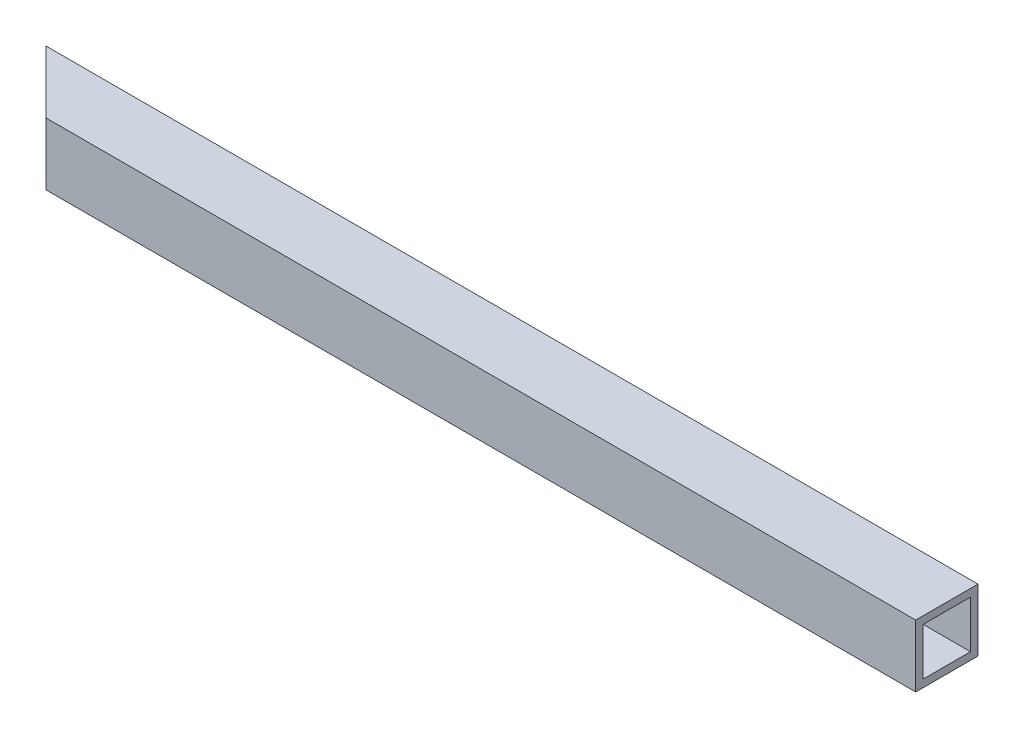
ISO-10303-21;
HEADER;
FILE_DESCRIPTION(('STEP AP214'),'2;1');
FILE_NAME('part.step','',(''),(''),'','','');
FILE_SCHEMA(('AUTOMOTIVE_DESIGN { 1 0 10303 214 1 1 1 1 }'));
ENDSEC;
DATA;
#1=APPLICATION_CONTEXT('core data for automotive mechanical design processes');
#2=APPLICATION_PROTOCOL_DEFINITION('international standard','automotive_design',2000,#1);
#3=PRODUCT_CONTEXT('',#1,'mechanical');
#4=PRODUCT('Part','Part','',(#3));
#5=PRODUCT_RELATED_PRODUCT_CATEGORY('part','',(#4));
#6=PRODUCT_DEFINITION_FORMATION('','',#4);
#7=PRODUCT_DEFINITION_CONTEXT('part definition',#1,'design');
#8=PRODUCT_DEFINITION('design','',#6,#7);
#9=PRODUCT_DEFINITION_SHAPE('','',#8);
#10=(LENGTH_UNIT() NAMED_UNIT(*) SI_UNIT(.MILLI.,.METRE.));
#11=(NAMED_UNIT(*) PLANE_ANGLE_UNIT() SI_UNIT($,.RADIAN.));
#12=(NAMED_UNIT(*) SI_UNIT($,.STERADIAN.) SOLID_ANGLE_UNIT());
#13=UNCERTAINTY_MEASURE_WITH_UNIT(LENGTH_MEASURE(1.E-05),#10,'distance_accuracy_value','');
#14=(GEOMETRIC_REPRESENTATION_CONTEXT(3) GLOBAL_UNCERTAINTY_ASSIGNED_CONTEXT((#13)) GLOBAL_UNIT_ASSIGNED_CONTEXT((#10,
#11,#12)) REPRESENTATION_CONTEXT('',''));
#15=CARTESIAN_POINT('',(0.,0.,0.));
#16=DIRECTION('',(0.,0.,1.));
#17=DIRECTION('',(1.,0.,0.));
#18=AXIS2_PLACEMENT_3D('',#15,#16,#17);
#19=CARTESIAN_POINT('',(-174.5,25.,-170.560948081264));
#20=DIRECTION('',(0.707106781186547,0.,-0.707106781186547));
#21=DIRECTION('',(-0.707106781186548,0.,-0.707106781186548));
#22=AXIS2_PLACEMENT_3D('',#19,#20,#21);
#23=PLANE('',#22);
#24=DIRECTION('',(0.707106781186547,0.,0.707106781186547));
#25=VECTOR('',#24,1.);
#26=CARTESIAN_POINT('',(-174.5,0.,-170.560948081264));
#27=LINE('',#26,#25);
#28=CARTESIAN_POINT('',(-199.5,0.,-195.560948081264));
#29=VERTEX_POINT('',#28);
#30=CARTESIAN_POINT('',(-174.5,0.,-170.560948081264));
#31=VERTEX_POINT('',#30);
#32=EDGE_CURVE('E129',#29,#31,#27,.T.);
#33=ORIENTED_EDGE('',*,*,#32,.T.);
#34=DIRECTION('',(0.,-1.,0.));
#35=VECTOR('',#34,1.);
#36=CARTESIAN_POINT('',(-174.5,25.,-170.560948081264));
#37=LINE('',#36,#35);
#38=CARTESIAN_POINT('',(-174.5,25.,-170.560948081264));
#39=VERTEX_POINT('',#38);
#40=EDGE_CURVE('E11',#39,#31,#37,.T.);
#41=ORIENTED_EDGE('',*,*,#40,.F.);
#42=DIRECTION('',(0.707106781186547,0.,0.707106781186547));
#43=VECTOR('',#42,1.);
#44=CARTESIAN_POINT('',(-174.5,25.,-170.560948081264));
#45=LINE('',#44,#43);
#46=CARTESIAN_POINT('',(-199.5,25.,-195.560948081264));
#47=VERTEX_POINT('',#46);
#48=EDGE_CURVE('E134',#47,#39,#45,.T.);
#49=ORIENTED_EDGE('',*,*,#48,.F.);
#50=DIRECTION('',(0.,-1.,0.));
#51=VECTOR('',#50,1.);
#52=CARTESIAN_POINT('',(-199.5,25.,-195.560948081264));
#53=LINE('',#52,#51);
#54=EDGE_CURVE('E144',#47,#29,#53,.T.);
#55=ORIENTED_EDGE('',*,*,#54,.T.);
#56=EDGE_LOOP('',(#33,#41,#49,#55));
#57=FACE_BOUND('',#56,.T.);
#58=DIRECTION('',(0.707106781186548,0.,0.707106781186548));
#59=VECTOR('',#58,1.);
#60=CARTESIAN_POINT('',(-1.96952595936798,3.,1.96952595936798));
#61=LINE('',#60,#59);
#62=CARTESIAN_POINT('',(-196.5,3.,-192.560948081264));
#63=VERTEX_POINT('',#62);
#64=CARTESIAN_POINT('',(-177.5,3.,-173.560948081264));
#65=VERTEX_POINT('',#64);
#66=EDGE_CURVE('E105',#63,#65,#61,.T.);
#67=ORIENTED_EDGE('',*,*,#66,.F.);
#68=DIRECTION('',(0.,-1.,0.));
#69=VECTOR('',#68,1.);
#70=CARTESIAN_POINT('',(-196.5,25.,-192.560948081264));
#71=LINE('',#70,#69);
#72=CARTESIAN_POINT('',(-196.5,22.,-192.560948081264));
#73=VERTEX_POINT('',#72);
#74=EDGE_CURVE('E125',#73,#63,#71,.T.);
#75=ORIENTED_EDGE('',*,*,#74,.F.);
#76=DIRECTION('',(0.707106781186548,0.,0.707106781186548));
#77=VECTOR('',#76,1.);
#78=CARTESIAN_POINT('',(-1.96952595936798,22.,1.96952595936798));
#79=LINE('',#78,#77);
#80=CARTESIAN_POINT('',(-177.5,22.,-173.560948081264));
#81=VERTEX_POINT('',#80);
#82=EDGE_CURVE('E49',#73,#81,#79,.T.);
#83=ORIENTED_EDGE('',*,*,#82,.T.);
#84=DIRECTION('',(0.,-1.,0.));
#85=VECTOR('',#84,1.);
#86=CARTESIAN_POINT('',(-177.5,25.,-173.560948081264));
#87=LINE('',#86,#85);
#88=EDGE_CURVE('E115',#81,#65,#87,.T.);
#89=ORIENTED_EDGE('',*,*,#88,.T.);
#90=EDGE_LOOP('',(#67,#75,#83,#89));
#91=FACE_BOUND('',#90,.T.);
#92=ADVANCED_FACE('F35',(#57,#91),#23,.F.);
#93=CARTESIAN_POINT('',(174.5,25.,-170.560948081264));
#94=DIRECTION('',(-1.,0.,0.));
#95=DIRECTION('',(0.,0.,1.));
#96=AXIS2_PLACEMENT_3D('',#93,#94,#95);
#97=PLANE('',#96);
#98=DIRECTION('',(0.,0.,-1.));
#99=VECTOR('',#98,1.);
#100=CARTESIAN_POINT('',(174.5,0.,-170.560948081264));
#101=LINE('',#100,#99);
#102=CARTESIAN_POINT('',(174.5,0.,-170.560948081264));
#103=VERTEX_POINT('',#102);
#104=CARTESIAN_POINT('',(174.5,0.,-195.560948081264));
#105=VERTEX_POINT('',#104);
#106=EDGE_CURVE('E149',#103,#105,#101,.T.);
#107=ORIENTED_EDGE('',*,*,#106,.T.);
#108=DIRECTION('',(0.,-1.,0.));
#109=VECTOR('',#108,1.);
#110=CARTESIAN_POINT('',(174.5,25.,-195.560948081264));
#111=LINE('',#110,#109);
#112=CARTESIAN_POINT('',(174.5,25.,-195.560948081264));
#113=VERTEX_POINT('',#112);
#114=EDGE_CURVE('E154',#113,#105,#111,.T.);
#115=ORIENTED_EDGE('',*,*,#114,.F.);
#116=DIRECTION('',(0.,0.,-1.));
#117=VECTOR('',#116,1.);
#118=CARTESIAN_POINT('',(174.5,25.,-170.560948081264));
#119=LINE('',#118,#117);
#120=CARTESIAN_POINT('',(174.5,25.,-170.560948081264));
#121=VERTEX_POINT('',#120);
#122=EDGE_CURVE('E140',#121,#113,#119,.T.);
#123=ORIENTED_EDGE('',*,*,#122,.F.);
#124=DIRECTION('',(0.,-1.,0.));
#125=VECTOR('',#124,1.);
#126=CARTESIAN_POINT('',(174.5,25.,-170.560948081264));
#127=LINE('',#126,#125);
#128=EDGE_CURVE('E42',#121,#103,#127,.T.);
#129=ORIENTED_EDGE('',*,*,#128,.T.);
#130=EDGE_LOOP('',(#107,#115,#123,#129));
#131=FACE_BOUND('',#130,.T.);
#132=DIRECTION('',(0.,0.,-1.));
#133=VECTOR('',#132,1.);
#134=CARTESIAN_POINT('',(174.5,3.,0.));
#135=LINE('',#134,#133);
#136=CARTESIAN_POINT('',(174.5,3.,-173.560948081264));
#137=VERTEX_POINT('',#136);
#138=CARTESIAN_POINT('',(174.5,3.,-192.560948081264));
#139=VERTEX_POINT('',#138);
#140=EDGE_CURVE('E102',#137,#139,#135,.T.);
#141=ORIENTED_EDGE('',*,*,#140,.F.);
#142=DIRECTION('',(0.,-1.,0.));
#143=VECTOR('',#142,1.);
#144=CARTESIAN_POINT('',(174.5,25.,-173.560948081264));
#145=LINE('',#144,#143);
#146=CARTESIAN_POINT('',(174.5,22.,-173.560948081264));
#147=VERTEX_POINT('',#146);
#148=EDGE_CURVE('E111',#147,#137,#145,.T.);
#149=ORIENTED_EDGE('',*,*,#148,.F.);
#150=DIRECTION('',(0.,0.,-1.));
#151=VECTOR('',#150,1.);
#152=CARTESIAN_POINT('',(174.5,22.,0.));
#153=LINE('',#152,#151);
#154=CARTESIAN_POINT('',(174.5,22.,-192.560948081264));
#155=VERTEX_POINT('',#154);
#156=EDGE_CURVE('E54',#147,#155,#153,.T.);
#157=ORIENTED_EDGE('',*,*,#156,.T.);
#158=DIRECTION('',(0.,-1.,0.));
#159=VECTOR('',#158,1.);
#160=CARTESIAN_POINT('',(174.5,25.,-192.560948081264));
#161=LINE('',#160,#159);
#162=EDGE_CURVE('E116',#155,#139,#161,.T.);
#163=ORIENTED_EDGE('',*,*,#162,.T.);
#164=EDGE_LOOP('',(#141,#149,#157,#163));
#165=FACE_BOUND('',#164,.T.);
#166=ADVANCED_FACE('F119',(#131,#165),#97,.F.);
#167=CARTESIAN_POINT('',(-174.5,25.,-170.560948081264));
#168=DIRECTION('',(0.,0.,-1.));
#169=DIRECTION('',(-1.,0.,0.));
#170=AXIS2_PLACEMENT_3D('',#167,#168,#169);
#171=PLANE('',#170);
#172=DIRECTION('',(1.,0.,0.));
#173=VECTOR('',#172,1.);
#174=CARTESIAN_POINT('',(-174.5,0.,-170.560948081264));
#175=LINE('',#174,#173);
#176=EDGE_CURVE('E147',#31,#103,#175,.T.);
#177=ORIENTED_EDGE('',*,*,#176,.T.);
#178=ORIENTED_EDGE('',*,*,#128,.F.);
#179=DIRECTION('',(1.,0.,0.));
#180=VECTOR('',#179,1.);
#181=CARTESIAN_POINT('',(-174.5,25.,-170.560948081264));
#182=LINE('',#181,#180);
#183=EDGE_CURVE('E137',#39,#121,#182,.T.);
#184=ORIENTED_EDGE('',*,*,#183,.F.);
#185=ORIENTED_EDGE('',*,*,#40,.T.);
#186=EDGE_LOOP('',(#177,#178,#184,#185));
#187=FACE_BOUND('',#186,.T.);
#188=ADVANCED_FACE('F177',(#187),#171,.F.);
#189=CARTESIAN_POINT('',(-199.5,25.,-195.560948081264));
#190=DIRECTION('',(0.,0.,1.));
#191=DIRECTION('',(1.,0.,0.));
#192=AXIS2_PLACEMENT_3D('',#189,#190,#191);
#193=PLANE('',#192);
#194=DIRECTION('',(-1.,0.,0.));
#195=VECTOR('',#194,1.);
#196=CARTESIAN_POINT('',(-199.5,0.,-195.560948081264));
#197=LINE('',#196,#195);
#198=EDGE_CURVE('E138',#105,#29,#197,.T.);
#199=ORIENTED_EDGE('',*,*,#198,.T.);
#200=ORIENTED_EDGE('',*,*,#54,.F.);
#201=DIRECTION('',(-1.,0.,0.));
#202=VECTOR('',#201,1.);
#203=CARTESIAN_POINT('',(-199.5,25.,-195.560948081264));
#204=LINE('',#203,#202);
#205=EDGE_CURVE('E142',#113,#47,#204,.T.);
#206=ORIENTED_EDGE('',*,*,#205,.F.);
#207=ORIENTED_EDGE('',*,*,#114,.T.);
#208=EDGE_LOOP('',(#199,#200,#206,#207));
#209=FACE_BOUND('',#208,.T.);
#210=ADVANCED_FACE('F169',(#209),#193,.F.);
#211=CARTESIAN_POINT('',(0.,25.,0.));
#212=DIRECTION('',(0.,-1.,0.));
#213=DIRECTION('',(0.,0.,-1.));
#214=AXIS2_PLACEMENT_3D('',#211,#212,#213);
#215=PLANE('',#214);
#216=ORIENTED_EDGE('',*,*,#48,.T.);
#217=ORIENTED_EDGE('',*,*,#183,.T.);
#218=ORIENTED_EDGE('',*,*,#122,.T.);
#219=ORIENTED_EDGE('',*,*,#205,.T.);
#220=EDGE_LOOP('',(#216,#217,#218,#219));
#221=FACE_BOUND('',#220,.T.);
#222=ADVANCED_FACE('F176',(#221),#215,.F.);
#223=CARTESIAN_POINT('',(0.,0.,0.));
#224=DIRECTION('',(0.,-1.,0.));
#225=DIRECTION('',(0.,0.,-1.));
#226=AXIS2_PLACEMENT_3D('',#223,#224,#225);
#227=PLANE('',#226);
#228=ORIENTED_EDGE('',*,*,#32,.F.);
#229=ORIENTED_EDGE('',*,*,#198,.F.);
#230=ORIENTED_EDGE('',*,*,#106,.F.);
#231=ORIENTED_EDGE('',*,*,#176,.F.);
#232=EDGE_LOOP('',(#228,#229,#230,#231));
#233=FACE_BOUND('',#232,.T.);
#234=ADVANCED_FACE('F166',(#233),#227,.T.);
#235=CARTESIAN_POINT('',(-174.5,25.,-173.560948081264));
#236=DIRECTION('',(0.,0.,-1.));
#237=DIRECTION('',(-1.,0.,0.));
#238=AXIS2_PLACEMENT_3D('',#235,#236,#237);
#239=PLANE('',#238);
#240=DIRECTION('',(1.,0.,0.));
#241=VECTOR('',#240,1.);
#242=CARTESIAN_POINT('',(0.,3.,-173.560948081264));
#243=LINE('',#242,#241);
#244=EDGE_CURVE('E98',#65,#137,#243,.T.);
#245=ORIENTED_EDGE('',*,*,#244,.F.);
#246=ORIENTED_EDGE('',*,*,#88,.F.);
#247=DIRECTION('',(1.,0.,0.));
#248=VECTOR('',#247,1.);
#249=CARTESIAN_POINT('',(0.,22.,-173.560948081264));
#250=LINE('',#249,#248);
#251=EDGE_CURVE('E113',#81,#147,#250,.T.);
#252=ORIENTED_EDGE('',*,*,#251,.T.);
#253=ORIENTED_EDGE('',*,*,#148,.T.);
#254=EDGE_LOOP('',(#245,#246,#252,#253));
#255=FACE_BOUND('',#254,.T.);
#256=ADVANCED_FACE('F112',(#255),#239,.T.);
#257=CARTESIAN_POINT('',(-199.5,25.,-192.560948081264));
#258=DIRECTION('',(0.,0.,1.));
#259=DIRECTION('',(1.,0.,0.));
#260=AXIS2_PLACEMENT_3D('',#257,#258,#259);
#261=PLANE('',#260);
#262=DIRECTION('',(-1.,0.,0.));
#263=VECTOR('',#262,1.);
#264=CARTESIAN_POINT('',(0.,3.,-192.560948081264));
#265=LINE('',#264,#263);
#266=EDGE_CURVE('E120',#139,#63,#265,.T.);
#267=ORIENTED_EDGE('',*,*,#266,.F.);
#268=ORIENTED_EDGE('',*,*,#162,.F.);
#269=DIRECTION('',(-1.,0.,0.));
#270=VECTOR('',#269,1.);
#271=CARTESIAN_POINT('',(0.,22.,-192.560948081264));
#272=LINE('',#271,#270);
#273=EDGE_CURVE('E127',#155,#73,#272,.T.);
#274=ORIENTED_EDGE('',*,*,#273,.T.);
#275=ORIENTED_EDGE('',*,*,#74,.T.);
#276=EDGE_LOOP('',(#267,#268,#274,#275));
#277=FACE_BOUND('',#276,.T.);
#278=ADVANCED_FACE('F203',(#277),#261,.T.);
#279=CARTESIAN_POINT('',(0.,22.,0.));
#280=DIRECTION('',(0.,-1.,0.));
#281=DIRECTION('',(0.,0.,-1.));
#282=AXIS2_PLACEMENT_3D('',#279,#280,#281);
#283=PLANE('',#282);
#284=ORIENTED_EDGE('',*,*,#82,.F.);
#285=ORIENTED_EDGE('',*,*,#273,.F.);
#286=ORIENTED_EDGE('',*,*,#156,.F.);
#287=ORIENTED_EDGE('',*,*,#251,.F.);
#288=EDGE_LOOP('',(#284,#285,#286,#287));
#289=FACE_BOUND('',#288,.T.);
#290=ADVANCED_FACE('F213',(#289),#283,.T.);
#291=CARTESIAN_POINT('',(0.,3.,0.));
#292=DIRECTION('',(0.,-1.,0.));
#293=DIRECTION('',(0.,0.,-1.));
#294=AXIS2_PLACEMENT_3D('',#291,#292,#293);
#295=PLANE('',#294);
#296=ORIENTED_EDGE('',*,*,#66,.T.);
#297=ORIENTED_EDGE('',*,*,#244,.T.);
#298=ORIENTED_EDGE('',*,*,#140,.T.);
#299=ORIENTED_EDGE('',*,*,#266,.T.);
#300=EDGE_LOOP('',(#296,#297,#298,#299));
#301=FACE_BOUND('',#300,.T.);
#302=ADVANCED_FACE('F100',(#301),#295,.F.);
#303=CLOSED_SHELL('',(#92,#166,#188,#210,#222,#234,#256,#278,#290,#302));
#304=MANIFOLD_SOLID_BREP('B2',#303);
#305=ADVANCED_BREP_SHAPE_REPRESENTATION('',(#18,#304),#14);
#306=SHAPE_DEFINITION_REPRESENTATION(#9,#305);
ENDSEC;
END-ISO-10303-21;
